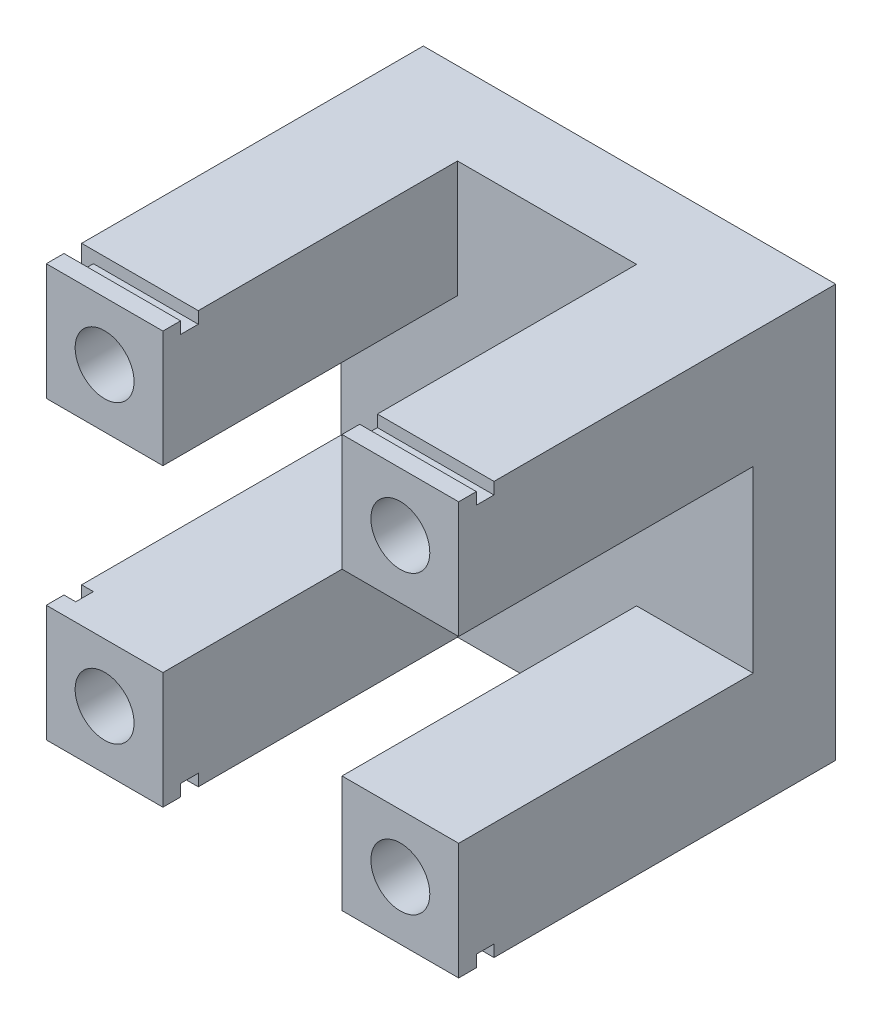
ISO-10303-21;
HEADER;
FILE_DESCRIPTION(('STEP AP214'),'2;1');
FILE_NAME('part.step','',(''),(''),'','','');
FILE_SCHEMA(('AUTOMOTIVE_DESIGN { 1 0 10303 214 1 1 1 1 }'));
ENDSEC;
DATA;
#1=APPLICATION_CONTEXT('core data for automotive mechanical design processes');
#2=APPLICATION_PROTOCOL_DEFINITION('international standard','automotive_design',2000,#1);
#3=PRODUCT_CONTEXT('',#1,'mechanical');
#4=PRODUCT('Part','Part','',(#3));
#5=PRODUCT_RELATED_PRODUCT_CATEGORY('part','',(#4));
#6=PRODUCT_DEFINITION_FORMATION('','',#4);
#7=PRODUCT_DEFINITION_CONTEXT('part definition',#1,'design');
#8=PRODUCT_DEFINITION('design','',#6,#7);
#9=PRODUCT_DEFINITION_SHAPE('','',#8);
#10=(LENGTH_UNIT() NAMED_UNIT(*) SI_UNIT(.MILLI.,.METRE.));
#11=(NAMED_UNIT(*) PLANE_ANGLE_UNIT() SI_UNIT($,.RADIAN.));
#12=(NAMED_UNIT(*) SI_UNIT($,.STERADIAN.) SOLID_ANGLE_UNIT());
#13=UNCERTAINTY_MEASURE_WITH_UNIT(LENGTH_MEASURE(1.E-05),#10,'distance_accuracy_value','');
#14=(GEOMETRIC_REPRESENTATION_CONTEXT(3) GLOBAL_UNCERTAINTY_ASSIGNED_CONTEXT((#13)) GLOBAL_UNIT_ASSIGNED_CONTEXT((#10,
#11,#12)) REPRESENTATION_CONTEXT('',''));
#15=CARTESIAN_POINT('',(0.,0.,0.));
#16=DIRECTION('',(0.,0.,1.));
#17=DIRECTION('',(1.,0.,0.));
#18=AXIS2_PLACEMENT_3D('',#15,#16,#17);
#19=CARTESIAN_POINT('',(-70.,0.,64.));
#20=DIRECTION('',(1.,0.,0.));
#21=DIRECTION('',(0.,0.,-1.));
#22=AXIS2_PLACEMENT_3D('',#19,#20,#21);
#23=PLANE('',#22);
#24=DIRECTION('',(0.,-1.,0.));
#25=VECTOR('',#24,1.);
#26=CARTESIAN_POINT('',(-70.,0.,58.));
#27=LINE('',#26,#25);
#28=CARTESIAN_POINT('',(-70.,19.8,58.));
#29=VERTEX_POINT('',#28);
#30=CARTESIAN_POINT('',(-70.,0.,58.));
#31=VERTEX_POINT('',#30);
#32=EDGE_CURVE('E303',#29,#31,#27,.T.);
#33=ORIENTED_EDGE('',*,*,#32,.F.);
#34=DIRECTION('',(0.,0.,1.));
#35=VECTOR('',#34,1.);
#36=CARTESIAN_POINT('',(-70.,19.8,14.));
#37=LINE('',#36,#35);
#38=CARTESIAN_POINT('',(-70.,19.8,14.));
#39=VERTEX_POINT('',#38);
#40=EDGE_CURVE('E454',#39,#29,#37,.T.);
#41=ORIENTED_EDGE('',*,*,#40,.F.);
#42=DIRECTION('',(0.,-1.,0.));
#43=VECTOR('',#42,1.);
#44=CARTESIAN_POINT('',(-70.,0.,14.));
#45=LINE('',#44,#43);
#46=CARTESIAN_POINT('',(-70.,50.2,14.));
#47=VERTEX_POINT('',#46);
#48=EDGE_CURVE('E376',#47,#39,#45,.T.);
#49=ORIENTED_EDGE('',*,*,#48,.F.);
#50=DIRECTION('',(0.,0.,1.));
#51=VECTOR('',#50,1.);
#52=CARTESIAN_POINT('',(-70.,50.2,14.));
#53=LINE('',#52,#51);
#54=CARTESIAN_POINT('',(-70.,50.2,58.));
#55=VERTEX_POINT('',#54);
#56=EDGE_CURVE('E457',#47,#55,#53,.T.);
#57=ORIENTED_EDGE('',*,*,#56,.T.);
#58=DIRECTION('',(0.,-1.,0.));
#59=VECTOR('',#58,1.);
#60=CARTESIAN_POINT('',(-70.,70.,58.));
#61=LINE('',#60,#59);
#62=CARTESIAN_POINT('',(-70.,70.,58.));
#63=VERTEX_POINT('',#62);
#64=EDGE_CURVE('E339',#63,#55,#61,.T.);
#65=ORIENTED_EDGE('',*,*,#64,.F.);
#66=DIRECTION('',(0.,0.,-1.));
#67=VECTOR('',#66,1.);
#68=CARTESIAN_POINT('',(-70.,70.,64.));
#69=LINE('',#68,#67);
#70=CARTESIAN_POINT('',(-70.,70.,0.));
#71=VERTEX_POINT('',#70);
#72=EDGE_CURVE('E498',#63,#71,#69,.T.);
#73=ORIENTED_EDGE('',*,*,#72,.T.);
#74=DIRECTION('',(0.,-1.,0.));
#75=VECTOR('',#74,1.);
#76=CARTESIAN_POINT('',(-70.,0.,0.));
#77=LINE('',#76,#75);
#78=CARTESIAN_POINT('',(-70.,0.,0.));
#79=VERTEX_POINT('',#78);
#80=EDGE_CURVE('E485',#71,#79,#77,.T.);
#81=ORIENTED_EDGE('',*,*,#80,.T.);
#82=DIRECTION('',(0.,0.,-1.));
#83=VECTOR('',#82,1.);
#84=CARTESIAN_POINT('',(-70.,0.,64.));
#85=LINE('',#84,#83);
#86=EDGE_CURVE('E494',#31,#79,#85,.T.);
#87=ORIENTED_EDGE('',*,*,#86,.F.);
#88=EDGE_LOOP('',(#33,#41,#49,#57,#65,#73,#81,#87));
#89=FACE_BOUND('',#88,.T.);
#90=ADVANCED_FACE('F33',(#89),#23,.F.);
#91=DIRECTION('',(0.,1.,0.));
#92=VECTOR('',#91,1.);
#93=CARTESIAN_POINT('',(-70.,70.,61.));
#94=LINE('',#93,#92);
#95=CARTESIAN_POINT('',(-70.,50.2,61.));
#96=VERTEX_POINT('',#95);
#97=CARTESIAN_POINT('',(-70.,70.,61.));
#98=VERTEX_POINT('',#97);
#99=EDGE_CURVE('E334',#96,#98,#94,.T.);
#100=ORIENTED_EDGE('',*,*,#99,.F.);
#101=CARTESIAN_POINT('',(-70.,50.2,64.));
#102=VERTEX_POINT('',#101);
#103=EDGE_CURVE('E460',#96,#102,#53,.T.);
#104=ORIENTED_EDGE('',*,*,#103,.T.);
#105=DIRECTION('',(0.,-1.,0.));
#106=VECTOR('',#105,1.);
#107=CARTESIAN_POINT('',(-70.,0.,64.));
#108=LINE('',#107,#106);
#109=CARTESIAN_POINT('',(-70.,70.,64.));
#110=VERTEX_POINT('',#109);
#111=EDGE_CURVE('E472',#110,#102,#108,.T.);
#112=ORIENTED_EDGE('',*,*,#111,.F.);
#113=EDGE_CURVE('E499',#110,#98,#69,.T.);
#114=ORIENTED_EDGE('',*,*,#113,.T.);
#115=EDGE_LOOP('',(#100,#104,#112,#114));
#116=FACE_BOUND('',#115,.T.);
#117=ADVANCED_FACE('F672',(#116),#23,.F.);
#118=CARTESIAN_POINT('',(0.,0.,64.));
#119=DIRECTION('',(0.,1.,0.));
#120=DIRECTION('',(-1.,0.,0.));
#121=AXIS2_PLACEMENT_3D('',#118,#119,#120);
#122=PLANE('',#121);
#123=DIRECTION('',(0.,0.,1.));
#124=VECTOR('',#123,1.);
#125=CARTESIAN_POINT('',(-19.8,0.,14.));
#126=LINE('',#125,#124);
#127=CARTESIAN_POINT('',(-19.8,0.,61.));
#128=VERTEX_POINT('',#127);
#129=CARTESIAN_POINT('',(-19.8,0.,64.));
#130=VERTEX_POINT('',#129);
#131=EDGE_CURVE('E447',#128,#130,#126,.T.);
#132=ORIENTED_EDGE('',*,*,#131,.F.);
#133=DIRECTION('',(-1.,0.,0.));
#134=VECTOR('',#133,1.);
#135=CARTESIAN_POINT('',(0.,0.,61.));
#136=LINE('',#135,#134);
#137=CARTESIAN_POINT('',(0.,0.,61.));
#138=VERTEX_POINT('',#137);
#139=EDGE_CURVE('E313',#138,#128,#136,.T.);
#140=ORIENTED_EDGE('',*,*,#139,.F.);
#141=DIRECTION('',(0.,0.,-1.));
#142=VECTOR('',#141,1.);
#143=CARTESIAN_POINT('',(0.,0.,64.));
#144=LINE('',#143,#142);
#145=CARTESIAN_POINT('',(0.,0.,64.));
#146=VERTEX_POINT('',#145);
#147=EDGE_CURVE('E491',#146,#138,#144,.T.);
#148=ORIENTED_EDGE('',*,*,#147,.F.);
#149=DIRECTION('',(1.,0.,0.));
#150=VECTOR('',#149,1.);
#151=CARTESIAN_POINT('',(0.,0.,64.));
#152=LINE('',#151,#150);
#153=EDGE_CURVE('E475',#130,#146,#152,.T.);
#154=ORIENTED_EDGE('',*,*,#153,.F.);
#155=EDGE_LOOP('',(#132,#140,#148,#154));
#156=FACE_BOUND('',#155,.T.);
#157=ADVANCED_FACE('F628',(#156),#122,.F.);
#158=CARTESIAN_POINT('',(-70.,0.,64.));
#159=VERTEX_POINT('',#158);
#160=CARTESIAN_POINT('',(-70.,0.,61.));
#161=VERTEX_POINT('',#160);
#162=EDGE_CURVE('E495',#159,#161,#85,.T.);
#163=ORIENTED_EDGE('',*,*,#162,.T.);
#164=CARTESIAN_POINT('',(-50.2,0.,61.));
#165=VERTEX_POINT('',#164);
#166=EDGE_CURVE('E316',#165,#161,#136,.T.);
#167=ORIENTED_EDGE('',*,*,#166,.F.);
#168=DIRECTION('',(0.,0.,1.));
#169=VECTOR('',#168,1.);
#170=CARTESIAN_POINT('',(-50.2,0.,14.));
#171=LINE('',#170,#169);
#172=CARTESIAN_POINT('',(-50.2,0.,64.));
#173=VERTEX_POINT('',#172);
#174=EDGE_CURVE('E451',#165,#173,#171,.T.);
#175=ORIENTED_EDGE('',*,*,#174,.T.);
#176=EDGE_CURVE('E476',#159,#173,#152,.T.);
#177=ORIENTED_EDGE('',*,*,#176,.F.);
#178=EDGE_LOOP('',(#163,#167,#175,#177));
#179=FACE_BOUND('',#178,.T.);
#180=ADVANCED_FACE('F530',(#179),#122,.F.);
#181=CARTESIAN_POINT('',(0.,70.,64.));
#182=DIRECTION('',(0.,-1.,0.));
#183=DIRECTION('',(0.,0.,-1.));
#184=AXIS2_PLACEMENT_3D('',#181,#182,#183);
#185=PLANE('',#184);
#186=DIRECTION('',(0.,0.,1.));
#187=VECTOR('',#186,1.);
#188=CARTESIAN_POINT('',(-50.2,70.,14.));
#189=LINE('',#188,#187);
#190=CARTESIAN_POINT('',(-50.2,70.,61.));
#191=VERTEX_POINT('',#190);
#192=CARTESIAN_POINT('',(-50.2,70.,64.));
#193=VERTEX_POINT('',#192);
#194=EDGE_CURVE('E430',#191,#193,#189,.T.);
#195=ORIENTED_EDGE('',*,*,#194,.F.);
#196=DIRECTION('',(-1.,0.,0.));
#197=VECTOR('',#196,1.);
#198=CARTESIAN_POINT('',(0.,70.,61.));
#199=LINE('',#198,#197);
#200=EDGE_CURVE('E345',#191,#98,#199,.T.);
#201=ORIENTED_EDGE('',*,*,#200,.T.);
#202=ORIENTED_EDGE('',*,*,#113,.F.);
#203=DIRECTION('',(-1.,0.,0.));
#204=VECTOR('',#203,1.);
#205=CARTESIAN_POINT('',(0.,70.,64.));
#206=LINE('',#205,#204);
#207=EDGE_CURVE('E466',#193,#110,#206,.T.);
#208=ORIENTED_EDGE('',*,*,#207,.F.);
#209=EDGE_LOOP('',(#195,#201,#202,#208));
#210=FACE_BOUND('',#209,.T.);
#211=ADVANCED_FACE('F579',(#210),#185,.F.);
#212=DIRECTION('',(0.,0.,-1.));
#213=VECTOR('',#212,1.);
#214=CARTESIAN_POINT('',(0.,70.,64.));
#215=LINE('',#214,#213);
#216=CARTESIAN_POINT('',(0.,70.,64.));
#217=VERTEX_POINT('',#216);
#218=CARTESIAN_POINT('',(0.,70.,61.));
#219=VERTEX_POINT('',#218);
#220=EDGE_CURVE('E503',#217,#219,#215,.T.);
#221=ORIENTED_EDGE('',*,*,#220,.T.);
#222=CARTESIAN_POINT('',(-19.8,70.,61.));
#223=VERTEX_POINT('',#222);
#224=EDGE_CURVE('E361',#219,#223,#199,.T.);
#225=ORIENTED_EDGE('',*,*,#224,.T.);
#226=DIRECTION('',(0.,0.,1.));
#227=VECTOR('',#226,1.);
#228=CARTESIAN_POINT('',(-19.8,70.,14.));
#229=LINE('',#228,#227);
#230=CARTESIAN_POINT('',(-19.8,70.,64.));
#231=VERTEX_POINT('',#230);
#232=EDGE_CURVE('E434',#223,#231,#229,.T.);
#233=ORIENTED_EDGE('',*,*,#232,.T.);
#234=EDGE_CURVE('E468',#217,#231,#206,.T.);
#235=ORIENTED_EDGE('',*,*,#234,.F.);
#236=EDGE_LOOP('',(#221,#225,#233,#235));
#237=FACE_BOUND('',#236,.T.);
#238=ADVANCED_FACE('F654',(#237),#185,.F.);
#239=CARTESIAN_POINT('',(0.,0.,64.));
#240=DIRECTION('',(-1.,0.,0.));
#241=DIRECTION('',(0.,0.,1.));
#242=AXIS2_PLACEMENT_3D('',#239,#240,#241);
#243=PLANE('',#242);
#244=ORIENTED_EDGE('',*,*,#147,.T.);
#245=DIRECTION('',(0.,1.,0.));
#246=VECTOR('',#245,1.);
#247=CARTESIAN_POINT('',(0.,0.,61.));
#248=LINE('',#247,#246);
#249=CARTESIAN_POINT('',(0.,1.99999999999999,61.));
#250=VERTEX_POINT('',#249);
#251=EDGE_CURVE('E299',#138,#250,#248,.T.);
#252=ORIENTED_EDGE('',*,*,#251,.T.);
#253=DIRECTION('',(0.,0.,-1.));
#254=VECTOR('',#253,1.);
#255=CARTESIAN_POINT('',(0.,1.99999999999999,61.));
#256=LINE('',#255,#254);
#257=CARTESIAN_POINT('',(0.,1.99999999999999,58.));
#258=VERTEX_POINT('',#257);
#259=EDGE_CURVE('E302',#250,#258,#256,.T.);
#260=ORIENTED_EDGE('',*,*,#259,.T.);
#261=DIRECTION('',(0.,-1.,0.));
#262=VECTOR('',#261,1.);
#263=CARTESIAN_POINT('',(0.,0.,58.));
#264=LINE('',#263,#262);
#265=CARTESIAN_POINT('',(0.,0.,58.));
#266=VERTEX_POINT('',#265);
#267=EDGE_CURVE('E306',#258,#266,#264,.T.);
#268=ORIENTED_EDGE('',*,*,#267,.T.);
#269=CARTESIAN_POINT('',(0.,0.,0.));
#270=VERTEX_POINT('',#269);
#271=EDGE_CURVE('E479',#266,#270,#144,.T.);
#272=ORIENTED_EDGE('',*,*,#271,.T.);
#273=DIRECTION('',(0.,1.,0.));
#274=VECTOR('',#273,1.);
#275=CARTESIAN_POINT('',(0.,0.,0.));
#276=LINE('',#275,#274);
#277=CARTESIAN_POINT('',(0.,70.,0.));
#278=VERTEX_POINT('',#277);
#279=EDGE_CURVE('E429',#270,#278,#276,.T.);
#280=ORIENTED_EDGE('',*,*,#279,.T.);
#281=CARTESIAN_POINT('',(0.,70.,58.));
#282=VERTEX_POINT('',#281);
#283=EDGE_CURVE('E502',#282,#278,#215,.T.);
#284=ORIENTED_EDGE('',*,*,#283,.F.);
#285=DIRECTION('',(0.,-1.,0.));
#286=VECTOR('',#285,1.);
#287=CARTESIAN_POINT('',(0.,70.,58.));
#288=LINE('',#287,#286);
#289=CARTESIAN_POINT('',(0.,68.,58.));
#290=VERTEX_POINT('',#289);
#291=EDGE_CURVE('E338',#282,#290,#288,.T.);
#292=ORIENTED_EDGE('',*,*,#291,.T.);
#293=DIRECTION('',(0.,0.,1.));
#294=VECTOR('',#293,1.);
#295=CARTESIAN_POINT('',(0.,68.,61.));
#296=LINE('',#295,#294);
#297=CARTESIAN_POINT('',(0.,68.,61.));
#298=VERTEX_POINT('',#297);
#299=EDGE_CURVE('E342',#290,#298,#296,.T.);
#300=ORIENTED_EDGE('',*,*,#299,.T.);
#301=DIRECTION('',(0.,1.,0.));
#302=VECTOR('',#301,1.);
#303=CARTESIAN_POINT('',(0.,70.,61.));
#304=LINE('',#303,#302);
#305=EDGE_CURVE('E335',#298,#219,#304,.T.);
#306=ORIENTED_EDGE('',*,*,#305,.T.);
#307=ORIENTED_EDGE('',*,*,#220,.F.);
#308=DIRECTION('',(0.,1.,0.));
#309=VECTOR('',#308,1.);
#310=CARTESIAN_POINT('',(0.,0.,64.));
#311=LINE('',#310,#309);
#312=CARTESIAN_POINT('',(0.,50.2,64.));
#313=VERTEX_POINT('',#312);
#314=EDGE_CURVE('E467',#313,#217,#311,.T.);
#315=ORIENTED_EDGE('',*,*,#314,.F.);
#316=DIRECTION('',(0.,0.,1.));
#317=VECTOR('',#316,1.);
#318=CARTESIAN_POINT('',(0.,50.2,14.));
#319=LINE('',#318,#317);
#320=CARTESIAN_POINT('',(0.,50.2,14.));
#321=VERTEX_POINT('',#320);
#322=EDGE_CURVE('E437',#321,#313,#319,.T.);
#323=ORIENTED_EDGE('',*,*,#322,.F.);
#324=DIRECTION('',(0.,1.,0.));
#325=VECTOR('',#324,1.);
#326=CARTESIAN_POINT('',(0.,0.,14.));
#327=LINE('',#326,#325);
#328=CARTESIAN_POINT('',(0.,19.8,14.));
#329=VERTEX_POINT('',#328);
#330=EDGE_CURVE('E393',#329,#321,#327,.T.);
#331=ORIENTED_EDGE('',*,*,#330,.F.);
#332=DIRECTION('',(0.,0.,1.));
#333=VECTOR('',#332,1.);
#334=CARTESIAN_POINT('',(0.,19.8,14.));
#335=LINE('',#334,#333);
#336=CARTESIAN_POINT('',(0.,19.8,64.));
#337=VERTEX_POINT('',#336);
#338=EDGE_CURVE('E439',#329,#337,#335,.T.);
#339=ORIENTED_EDGE('',*,*,#338,.T.);
#340=EDGE_CURVE('E463',#146,#337,#311,.T.);
#341=ORIENTED_EDGE('',*,*,#340,.F.);
#342=EDGE_LOOP('',(#244,#252,#260,#268,#272,#280,#284,#292,#300,#306,#307,#315,#323,#331,#339,#341));
#343=FACE_BOUND('',#342,.T.);
#344=ADVANCED_FACE('F35',(#343),#243,.F.);
#345=ORIENTED_EDGE('',*,*,#72,.F.);
#346=DIRECTION('',(-1.,0.,0.));
#347=VECTOR('',#346,1.);
#348=CARTESIAN_POINT('',(0.,70.,58.));
#349=LINE('',#348,#347);
#350=CARTESIAN_POINT('',(-50.2,70.,58.));
#351=VERTEX_POINT('',#350);
#352=EDGE_CURVE('E360',#351,#63,#349,.T.);
#353=ORIENTED_EDGE('',*,*,#352,.F.);
#354=CARTESIAN_POINT('',(-50.2,70.,14.));
#355=VERTEX_POINT('',#354);
#356=EDGE_CURVE('E426',#355,#351,#189,.T.);
#357=ORIENTED_EDGE('',*,*,#356,.F.);
#358=DIRECTION('',(-1.,0.,0.));
#359=VECTOR('',#358,1.);
#360=CARTESIAN_POINT('',(0.,70.,14.));
#361=LINE('',#360,#359);
#362=CARTESIAN_POINT('',(-19.8,70.,14.));
#363=VERTEX_POINT('',#362);
#364=EDGE_CURVE('E401',#363,#355,#361,.T.);
#365=ORIENTED_EDGE('',*,*,#364,.F.);
#366=CARTESIAN_POINT('',(-19.8,70.,58.));
#367=VERTEX_POINT('',#366);
#368=EDGE_CURVE('E431',#363,#367,#229,.T.);
#369=ORIENTED_EDGE('',*,*,#368,.T.);
#370=EDGE_CURVE('E358',#282,#367,#349,.T.);
#371=ORIENTED_EDGE('',*,*,#370,.F.);
#372=ORIENTED_EDGE('',*,*,#283,.T.);
#373=DIRECTION('',(-1.,0.,0.));
#374=VECTOR('',#373,1.);
#375=CARTESIAN_POINT('',(0.,70.,0.));
#376=LINE('',#375,#374);
#377=EDGE_CURVE('E482',#278,#71,#376,.T.);
#378=ORIENTED_EDGE('',*,*,#377,.T.);
#379=EDGE_LOOP('',(#345,#353,#357,#365,#369,#371,#372,#378));
#380=FACE_BOUND('',#379,.T.);
#381=ADVANCED_FACE('F596',(#380),#185,.F.);
#382=CARTESIAN_POINT('',(0.,0.,64.));
#383=DIRECTION('',(0.,0.,1.));
#384=DIRECTION('',(1.,0.,0.));
#385=AXIS2_PLACEMENT_3D('',#382,#383,#384);
#386=PLANE('',#385);
#387=CARTESIAN_POINT('',(-9.90000000000009,60.1000000000001,64.));
#388=DIRECTION('',(0.,0.,1.));
#389=DIRECTION('',(0.,1.,0.));
#390=AXIS2_PLACEMENT_3D('',#387,#388,#389);
#391=CIRCLE('',#390,5.);
#392=CARTESIAN_POINT('',(-9.90000000000011,65.1000000000001,64.));
#393=VERTEX_POINT('',#392);
#394=EDGE_CURVE('E707',#393,#393,#391,.T.);
#395=ORIENTED_EDGE('',*,*,#394,.F.);
#396=EDGE_LOOP('',(#395));
#397=FACE_BOUND('',#396,.T.);
#398=DIRECTION('',(0.,1.,0.));
#399=VECTOR('',#398,1.);
#400=CARTESIAN_POINT('',(-19.8,0.,64.));
#401=LINE('',#400,#399);
#402=CARTESIAN_POINT('',(-19.8,50.2,64.));
#403=VERTEX_POINT('',#402);
#404=EDGE_CURVE('E374',#403,#231,#401,.T.);
#405=ORIENTED_EDGE('',*,*,#404,.F.);
#406=DIRECTION('',(1.,0.,0.));
#407=VECTOR('',#406,1.);
#408=CARTESIAN_POINT('',(0.,50.2,64.));
#409=LINE('',#408,#407);
#410=EDGE_CURVE('E421',#403,#313,#409,.T.);
#411=ORIENTED_EDGE('',*,*,#410,.T.);
#412=ORIENTED_EDGE('',*,*,#314,.T.);
#413=ORIENTED_EDGE('',*,*,#234,.T.);
#414=EDGE_LOOP('',(#405,#411,#412,#413));
#415=FACE_BOUND('',#414,.T.);
#416=ADVANCED_FACE('F650',(#397,#415),#386,.T.);
#417=CARTESIAN_POINT('',(-60.0999999999998,9.89999999999975,64.));
#418=DIRECTION('',(0.,0.,1.));
#419=DIRECTION('',(0.,-1.,0.));
#420=AXIS2_PLACEMENT_3D('',#417,#418,#419);
#421=CIRCLE('',#420,5.);
#422=CARTESIAN_POINT('',(-60.0999999999997,4.89999999999974,64.));
#423=VERTEX_POINT('',#422);
#424=EDGE_CURVE('E828',#423,#423,#421,.T.);
#425=ORIENTED_EDGE('',*,*,#424,.F.);
#426=EDGE_LOOP('',(#425));
#427=FACE_BOUND('',#426,.T.);
#428=ORIENTED_EDGE('',*,*,#176,.T.);
#429=DIRECTION('',(0.,1.,0.));
#430=VECTOR('',#429,1.);
#431=CARTESIAN_POINT('',(-50.2,0.,64.));
#432=LINE('',#431,#430);
#433=CARTESIAN_POINT('',(-50.2,19.8,64.));
#434=VERTEX_POINT('',#433);
#435=EDGE_CURVE('E413',#173,#434,#432,.T.);
#436=ORIENTED_EDGE('',*,*,#435,.T.);
#437=DIRECTION('',(1.,0.,0.));
#438=VECTOR('',#437,1.);
#439=CARTESIAN_POINT('',(0.,19.8,64.));
#440=LINE('',#439,#438);
#441=CARTESIAN_POINT('',(-70.,19.8,64.));
#442=VERTEX_POINT('',#441);
#443=EDGE_CURVE('E410',#442,#434,#440,.T.);
#444=ORIENTED_EDGE('',*,*,#443,.F.);
#445=EDGE_CURVE('E471',#442,#159,#108,.T.);
#446=ORIENTED_EDGE('',*,*,#445,.T.);
#447=EDGE_LOOP('',(#428,#436,#444,#446));
#448=FACE_BOUND('',#447,.T.);
#449=ADVANCED_FACE('F537',(#427,#448),#386,.T.);
#450=CARTESIAN_POINT('',(-60.1,60.1,64.));
#451=DIRECTION('',(0.,0.,1.));
#452=DIRECTION('',(-1.,0.,0.));
#453=AXIS2_PLACEMENT_3D('',#450,#451,#452);
#454=CIRCLE('',#453,5.);
#455=CARTESIAN_POINT('',(-65.1,60.1,64.));
#456=VERTEX_POINT('',#455);
#457=EDGE_CURVE('E715',#456,#456,#454,.T.);
#458=ORIENTED_EDGE('',*,*,#457,.F.);
#459=EDGE_LOOP('',(#458));
#460=FACE_BOUND('',#459,.T.);
#461=DIRECTION('',(1.,0.,0.));
#462=VECTOR('',#461,1.);
#463=CARTESIAN_POINT('',(0.,50.2,64.));
#464=LINE('',#463,#462);
#465=CARTESIAN_POINT('',(-50.2,50.2,64.));
#466=VERTEX_POINT('',#465);
#467=EDGE_CURVE('E407',#102,#466,#464,.T.);
#468=ORIENTED_EDGE('',*,*,#467,.T.);
#469=DIRECTION('',(0.,1.,0.));
#470=VECTOR('',#469,1.);
#471=CARTESIAN_POINT('',(-50.2,0.,64.));
#472=LINE('',#471,#470);
#473=EDGE_CURVE('E370',#466,#193,#472,.T.);
#474=ORIENTED_EDGE('',*,*,#473,.T.);
#475=ORIENTED_EDGE('',*,*,#207,.T.);
#476=ORIENTED_EDGE('',*,*,#111,.T.);
#477=EDGE_LOOP('',(#468,#474,#475,#476));
#478=FACE_BOUND('',#477,.T.);
#479=ADVANCED_FACE('F583',(#460,#478),#386,.T.);
#480=CARTESIAN_POINT('',(-70.,19.8,61.));
#481=VERTEX_POINT('',#480);
#482=EDGE_CURVE('E456',#481,#442,#37,.T.);
#483=ORIENTED_EDGE('',*,*,#482,.F.);
#484=DIRECTION('',(0.,1.,0.));
#485=VECTOR('',#484,1.);
#486=CARTESIAN_POINT('',(-70.,0.,61.));
#487=LINE('',#486,#485);
#488=EDGE_CURVE('E267',#161,#481,#487,.T.);
#489=ORIENTED_EDGE('',*,*,#488,.F.);
#490=ORIENTED_EDGE('',*,*,#162,.F.);
#491=ORIENTED_EDGE('',*,*,#445,.F.);
#492=EDGE_LOOP('',(#483,#489,#490,#491));
#493=FACE_BOUND('',#492,.T.);
#494=ADVANCED_FACE('F540',(#493),#23,.F.);
#495=ORIENTED_EDGE('',*,*,#271,.F.);
#496=DIRECTION('',(-1.,0.,0.));
#497=VECTOR('',#496,1.);
#498=CARTESIAN_POINT('',(0.,0.,58.));
#499=LINE('',#498,#497);
#500=CARTESIAN_POINT('',(-19.8,0.,58.));
#501=VERTEX_POINT('',#500);
#502=EDGE_CURVE('E317',#266,#501,#499,.T.);
#503=ORIENTED_EDGE('',*,*,#502,.T.);
#504=CARTESIAN_POINT('',(-19.8,0.,14.));
#505=VERTEX_POINT('',#504);
#506=EDGE_CURVE('E444',#505,#501,#126,.T.);
#507=ORIENTED_EDGE('',*,*,#506,.F.);
#508=DIRECTION('',(1.,0.,0.));
#509=VECTOR('',#508,1.);
#510=CARTESIAN_POINT('',(0.,0.,14.));
#511=LINE('',#510,#509);
#512=CARTESIAN_POINT('',(-50.2,0.,14.));
#513=VERTEX_POINT('',#512);
#514=EDGE_CURVE('E384',#513,#505,#511,.T.);
#515=ORIENTED_EDGE('',*,*,#514,.F.);
#516=CARTESIAN_POINT('',(-50.2,0.,58.));
#517=VERTEX_POINT('',#516);
#518=EDGE_CURVE('E448',#513,#517,#171,.T.);
#519=ORIENTED_EDGE('',*,*,#518,.T.);
#520=EDGE_CURVE('E320',#517,#31,#499,.T.);
#521=ORIENTED_EDGE('',*,*,#520,.T.);
#522=ORIENTED_EDGE('',*,*,#86,.T.);
#523=DIRECTION('',(1.,0.,0.));
#524=VECTOR('',#523,1.);
#525=CARTESIAN_POINT('',(0.,0.,0.));
#526=LINE('',#525,#524);
#527=EDGE_CURVE('E488',#79,#270,#526,.T.);
#528=ORIENTED_EDGE('',*,*,#527,.T.);
#529=EDGE_LOOP('',(#495,#503,#507,#515,#519,#521,#522,#528));
#530=FACE_BOUND('',#529,.T.);
#531=ADVANCED_FACE('F608',(#530),#122,.F.);
#532=CARTESIAN_POINT('',(-9.90000000000001,9.9,64.));
#533=DIRECTION('',(0.,0.,1.));
#534=DIRECTION('',(1.,0.,0.));
#535=AXIS2_PLACEMENT_3D('',#532,#533,#534);
#536=CIRCLE('',#535,5.);
#537=CARTESIAN_POINT('',(-4.90000000000001,9.9,64.));
#538=VERTEX_POINT('',#537);
#539=EDGE_CURVE('E556',#538,#538,#536,.T.);
#540=ORIENTED_EDGE('',*,*,#539,.F.);
#541=EDGE_LOOP('',(#540));
#542=FACE_BOUND('',#541,.T.);
#543=DIRECTION('',(1.,0.,0.));
#544=VECTOR('',#543,1.);
#545=CARTESIAN_POINT('',(0.,19.8,64.));
#546=LINE('',#545,#544);
#547=CARTESIAN_POINT('',(-19.8,19.8,64.));
#548=VERTEX_POINT('',#547);
#549=EDGE_CURVE('E419',#548,#337,#546,.T.);
#550=ORIENTED_EDGE('',*,*,#549,.F.);
#551=DIRECTION('',(0.,1.,0.));
#552=VECTOR('',#551,1.);
#553=CARTESIAN_POINT('',(-19.8,0.,64.));
#554=LINE('',#553,#552);
#555=EDGE_CURVE('E416',#130,#548,#554,.T.);
#556=ORIENTED_EDGE('',*,*,#555,.F.);
#557=ORIENTED_EDGE('',*,*,#153,.T.);
#558=ORIENTED_EDGE('',*,*,#340,.T.);
#559=EDGE_LOOP('',(#550,#556,#557,#558));
#560=FACE_BOUND('',#559,.T.);
#561=ADVANCED_FACE('F622',(#542,#560),#386,.T.);
#562=CARTESIAN_POINT('',(0.,0.,0.));
#563=DIRECTION('',(0.,0.,1.));
#564=DIRECTION('',(1.,0.,0.));
#565=AXIS2_PLACEMENT_3D('',#562,#563,#564);
#566=PLANE('',#565);
#567=CARTESIAN_POINT('',(-60.0999999999998,9.89999999999975,0.));
#568=DIRECTION('',(0.,0.,1.));
#569=DIRECTION('',(0.,-1.,0.));
#570=AXIS2_PLACEMENT_3D('',#567,#568,#569);
#571=CIRCLE('',#570,5.);
#572=CARTESIAN_POINT('',(-60.0999999999997,4.89999999999974,0.));
#573=VERTEX_POINT('',#572);
#574=EDGE_CURVE('E825',#573,#573,#571,.T.);
#575=ORIENTED_EDGE('',*,*,#574,.T.);
#576=EDGE_LOOP('',(#575));
#577=FACE_BOUND('',#576,.T.);
#578=CARTESIAN_POINT('',(-60.1,60.1,0.));
#579=DIRECTION('',(0.,0.,1.));
#580=DIRECTION('',(-1.,0.,0.));
#581=AXIS2_PLACEMENT_3D('',#578,#579,#580);
#582=CIRCLE('',#581,5.);
#583=CARTESIAN_POINT('',(-65.1,60.1,0.));
#584=VERTEX_POINT('',#583);
#585=EDGE_CURVE('E710',#584,#584,#582,.T.);
#586=ORIENTED_EDGE('',*,*,#585,.T.);
#587=EDGE_LOOP('',(#586));
#588=FACE_BOUND('',#587,.T.);
#589=CARTESIAN_POINT('',(-9.90000000000009,60.1000000000001,0.));
#590=DIRECTION('',(0.,0.,1.));
#591=DIRECTION('',(0.,1.,0.));
#592=AXIS2_PLACEMENT_3D('',#589,#590,#591);
#593=CIRCLE('',#592,5.);
#594=CARTESIAN_POINT('',(-9.90000000000011,65.1000000000001,0.));
#595=VERTEX_POINT('',#594);
#596=EDGE_CURVE('E709',#595,#595,#593,.T.);
#597=ORIENTED_EDGE('',*,*,#596,.T.);
#598=EDGE_LOOP('',(#597));
#599=FACE_BOUND('',#598,.T.);
#600=CARTESIAN_POINT('',(-9.90000000000001,9.9,0.));
#601=DIRECTION('',(0.,0.,1.));
#602=DIRECTION('',(1.,0.,0.));
#603=AXIS2_PLACEMENT_3D('',#600,#601,#602);
#604=CIRCLE('',#603,5.);
#605=CARTESIAN_POINT('',(-4.90000000000001,9.9,0.));
#606=VERTEX_POINT('',#605);
#607=EDGE_CURVE('E558',#606,#606,#604,.T.);
#608=ORIENTED_EDGE('',*,*,#607,.T.);
#609=EDGE_LOOP('',(#608));
#610=FACE_BOUND('',#609,.T.);
#611=ORIENTED_EDGE('',*,*,#279,.F.);
#612=ORIENTED_EDGE('',*,*,#527,.F.);
#613=ORIENTED_EDGE('',*,*,#80,.F.);
#614=ORIENTED_EDGE('',*,*,#377,.F.);
#615=EDGE_LOOP('',(#611,#612,#613,#614));
#616=FACE_BOUND('',#615,.T.);
#617=ADVANCED_FACE('F605',(#577,#588,#599,#610,#616),#566,.F.);
#618=CARTESIAN_POINT('',(-50.2,0.,14.));
#619=DIRECTION('',(1.,0.,0.));
#620=DIRECTION('',(0.,0.,-1.));
#621=AXIS2_PLACEMENT_3D('',#618,#619,#620);
#622=PLANE('',#621);
#623=DIRECTION('',(0.,-1.,0.));
#624=VECTOR('',#623,1.);
#625=CARTESIAN_POINT('',(-50.2,1.63064006741821E-13,61.0000000000002));
#626=LINE('',#625,#624);
#627=CARTESIAN_POINT('',(-50.2,68.,61.));
#628=VERTEX_POINT('',#627);
#629=EDGE_CURVE('E368',#191,#628,#626,.T.);
#630=ORIENTED_EDGE('',*,*,#629,.F.);
#631=ORIENTED_EDGE('',*,*,#194,.T.);
#632=ORIENTED_EDGE('',*,*,#473,.F.);
#633=DIRECTION('',(0.,0.,1.));
#634=VECTOR('',#633,1.);
#635=CARTESIAN_POINT('',(-50.2,50.2,14.));
#636=LINE('',#635,#634);
#637=CARTESIAN_POINT('',(-50.2,50.2,14.));
#638=VERTEX_POINT('',#637);
#639=EDGE_CURVE('E404',#638,#466,#636,.T.);
#640=ORIENTED_EDGE('',*,*,#639,.F.);
#641=DIRECTION('',(0.,1.,0.));
#642=VECTOR('',#641,1.);
#643=CARTESIAN_POINT('',(-50.2,0.,14.));
#644=LINE('',#643,#642);
#645=EDGE_CURVE('E371',#638,#355,#644,.T.);
#646=ORIENTED_EDGE('',*,*,#645,.T.);
#647=ORIENTED_EDGE('',*,*,#356,.T.);
#648=DIRECTION('',(0.,1.,0.));
#649=VECTOR('',#648,1.);
#650=CARTESIAN_POINT('',(-50.2,0.,58.));
#651=LINE('',#650,#649);
#652=CARTESIAN_POINT('',(-50.2,68.,58.));
#653=VERTEX_POINT('',#652);
#654=EDGE_CURVE('E352',#653,#351,#651,.T.);
#655=ORIENTED_EDGE('',*,*,#654,.F.);
#656=DIRECTION('',(0.,0.,-1.));
#657=VECTOR('',#656,1.);
#658=CARTESIAN_POINT('',(-50.2,67.9999999999998,13.9999999999997));
#659=LINE('',#658,#657);
#660=EDGE_CURVE('E365',#628,#653,#659,.T.);
#661=ORIENTED_EDGE('',*,*,#660,.F.);
#662=EDGE_LOOP('',(#630,#631,#632,#640,#646,#647,#655,#661));
#663=FACE_BOUND('',#662,.T.);
#664=ADVANCED_FACE('F575',(#663),#622,.T.);
#665=CARTESIAN_POINT('',(-19.8,0.,14.));
#666=DIRECTION('',(1.,0.,0.));
#667=DIRECTION('',(0.,1.,0.));
#668=AXIS2_PLACEMENT_3D('',#665,#666,#667);
#669=PLANE('',#668);
#670=ORIENTED_EDGE('',*,*,#232,.F.);
#671=DIRECTION('',(0.,-1.,0.));
#672=VECTOR('',#671,1.);
#673=CARTESIAN_POINT('',(-19.8,1.64045364593945E-13,61.0000000000002));
#674=LINE('',#673,#672);
#675=CARTESIAN_POINT('',(-19.8,68.,61.));
#676=VERTEX_POINT('',#675);
#677=EDGE_CURVE('E512',#223,#676,#674,.T.);
#678=ORIENTED_EDGE('',*,*,#677,.T.);
#679=DIRECTION('',(0.,0.,-1.));
#680=VECTOR('',#679,1.);
#681=CARTESIAN_POINT('',(-19.8,67.9999999999998,13.9999999999997));
#682=LINE('',#681,#680);
#683=CARTESIAN_POINT('',(-19.8,68.,58.));
#684=VERTEX_POINT('',#683);
#685=EDGE_CURVE('E509',#676,#684,#682,.T.);
#686=ORIENTED_EDGE('',*,*,#685,.T.);
#687=DIRECTION('',(0.,1.,0.));
#688=VECTOR('',#687,1.);
#689=CARTESIAN_POINT('',(-19.8,0.,58.));
#690=LINE('',#689,#688);
#691=EDGE_CURVE('E506',#684,#367,#690,.T.);
#692=ORIENTED_EDGE('',*,*,#691,.T.);
#693=ORIENTED_EDGE('',*,*,#368,.F.);
#694=DIRECTION('',(0.,1.,0.));
#695=VECTOR('',#694,1.);
#696=CARTESIAN_POINT('',(-19.8,0.,14.));
#697=LINE('',#696,#695);
#698=CARTESIAN_POINT('',(-19.8,50.2,14.));
#699=VERTEX_POINT('',#698);
#700=EDGE_CURVE('E398',#699,#363,#697,.T.);
#701=ORIENTED_EDGE('',*,*,#700,.F.);
#702=DIRECTION('',(0.,0.,1.));
#703=VECTOR('',#702,1.);
#704=CARTESIAN_POINT('',(-19.8,50.2,14.));
#705=LINE('',#704,#703);
#706=EDGE_CURVE('E435',#699,#403,#705,.T.);
#707=ORIENTED_EDGE('',*,*,#706,.T.);
#708=ORIENTED_EDGE('',*,*,#404,.T.);
#709=EDGE_LOOP('',(#670,#678,#686,#692,#693,#701,#707,#708));
#710=FACE_BOUND('',#709,.T.);
#711=ADVANCED_FACE('F642',(#710),#669,.F.);
#712=CARTESIAN_POINT('',(0.,50.2,14.));
#713=DIRECTION('',(0.,-1.,0.));
#714=DIRECTION('',(0.,0.,-1.));
#715=AXIS2_PLACEMENT_3D('',#712,#713,#714);
#716=PLANE('',#715);
#717=ORIENTED_EDGE('',*,*,#410,.F.);
#718=ORIENTED_EDGE('',*,*,#706,.F.);
#719=DIRECTION('',(1.,0.,0.));
#720=VECTOR('',#719,1.);
#721=CARTESIAN_POINT('',(0.,50.2,14.));
#722=LINE('',#721,#720);
#723=EDGE_CURVE('E396',#699,#321,#722,.T.);
#724=ORIENTED_EDGE('',*,*,#723,.T.);
#725=ORIENTED_EDGE('',*,*,#322,.T.);
#726=EDGE_LOOP('',(#717,#718,#724,#725));
#727=FACE_BOUND('',#726,.T.);
#728=ADVANCED_FACE('F646',(#727),#716,.T.);
#729=CARTESIAN_POINT('',(0.,19.8,14.));
#730=DIRECTION('',(0.,-1.,0.));
#731=DIRECTION('',(0.,0.,-1.));
#732=AXIS2_PLACEMENT_3D('',#729,#730,#731);
#733=PLANE('',#732);
#734=ORIENTED_EDGE('',*,*,#549,.T.);
#735=ORIENTED_EDGE('',*,*,#338,.F.);
#736=DIRECTION('',(1.,0.,0.));
#737=VECTOR('',#736,1.);
#738=CARTESIAN_POINT('',(0.,19.8,14.));
#739=LINE('',#738,#737);
#740=CARTESIAN_POINT('',(-19.8,19.8,14.));
#741=VERTEX_POINT('',#740);
#742=EDGE_CURVE('E390',#741,#329,#739,.T.);
#743=ORIENTED_EDGE('',*,*,#742,.F.);
#744=DIRECTION('',(0.,0.,1.));
#745=VECTOR('',#744,1.);
#746=CARTESIAN_POINT('',(-19.8,19.8,14.));
#747=LINE('',#746,#745);
#748=EDGE_CURVE('E442',#741,#548,#747,.T.);
#749=ORIENTED_EDGE('',*,*,#748,.T.);
#750=EDGE_LOOP('',(#734,#735,#743,#749));
#751=FACE_BOUND('',#750,.T.);
#752=ADVANCED_FACE('F617',(#751),#733,.F.);
#753=CARTESIAN_POINT('',(-19.8,0.,14.));
#754=DIRECTION('',(1.,0.,0.));
#755=DIRECTION('',(0.,1.,0.));
#756=AXIS2_PLACEMENT_3D('',#753,#754,#755);
#757=PLANE('',#756);
#758=DIRECTION('',(0.,0.,1.));
#759=VECTOR('',#758,1.);
#760=CARTESIAN_POINT('',(-19.8,1.99999999999998,14.));
#761=LINE('',#760,#759);
#762=CARTESIAN_POINT('',(-19.8,1.99999999999999,58.));
#763=VERTEX_POINT('',#762);
#764=CARTESIAN_POINT('',(-19.8,1.99999999999999,61.));
#765=VERTEX_POINT('',#764);
#766=EDGE_CURVE('E315',#763,#765,#761,.T.);
#767=ORIENTED_EDGE('',*,*,#766,.T.);
#768=DIRECTION('',(0.,-1.,0.));
#769=VECTOR('',#768,1.);
#770=CARTESIAN_POINT('',(-19.8,0.,61.));
#771=LINE('',#770,#769);
#772=EDGE_CURVE('E331',#765,#128,#771,.T.);
#773=ORIENTED_EDGE('',*,*,#772,.T.);
#774=ORIENTED_EDGE('',*,*,#131,.T.);
#775=ORIENTED_EDGE('',*,*,#555,.T.);
#776=ORIENTED_EDGE('',*,*,#748,.F.);
#777=DIRECTION('',(0.,1.,0.));
#778=VECTOR('',#777,1.);
#779=CARTESIAN_POINT('',(-19.8,0.,14.));
#780=LINE('',#779,#778);
#781=EDGE_CURVE('E387',#505,#741,#780,.T.);
#782=ORIENTED_EDGE('',*,*,#781,.F.);
#783=ORIENTED_EDGE('',*,*,#506,.T.);
#784=DIRECTION('',(0.,1.,0.));
#785=VECTOR('',#784,1.);
#786=CARTESIAN_POINT('',(-19.8,0.,58.));
#787=LINE('',#786,#785);
#788=EDGE_CURVE('E328',#501,#763,#787,.T.);
#789=ORIENTED_EDGE('',*,*,#788,.T.);
#790=EDGE_LOOP('',(#767,#773,#774,#775,#776,#782,#783,#789));
#791=FACE_BOUND('',#790,.T.);
#792=ADVANCED_FACE('F613',(#791),#757,.F.);
#793=CARTESIAN_POINT('',(-50.2,0.,14.));
#794=DIRECTION('',(1.,0.,0.));
#795=DIRECTION('',(0.,0.,-1.));
#796=AXIS2_PLACEMENT_3D('',#793,#794,#795);
#797=PLANE('',#796);
#798=DIRECTION('',(0.,-1.,0.));
#799=VECTOR('',#798,1.);
#800=CARTESIAN_POINT('',(-50.2,0.,61.));
#801=LINE('',#800,#799);
#802=CARTESIAN_POINT('',(-50.2,1.99999999999999,61.));
#803=VERTEX_POINT('',#802);
#804=EDGE_CURVE('E11',#803,#165,#801,.T.);
#805=ORIENTED_EDGE('',*,*,#804,.F.);
#806=DIRECTION('',(0.,0.,1.));
#807=VECTOR('',#806,1.);
#808=CARTESIAN_POINT('',(-50.2,1.99999999999998,14.));
#809=LINE('',#808,#807);
#810=CARTESIAN_POINT('',(-50.2,1.99999999999999,58.));
#811=VERTEX_POINT('',#810);
#812=EDGE_CURVE('E515',#811,#803,#809,.T.);
#813=ORIENTED_EDGE('',*,*,#812,.F.);
#814=DIRECTION('',(0.,1.,0.));
#815=VECTOR('',#814,1.);
#816=CARTESIAN_POINT('',(-50.2,0.,58.));
#817=LINE('',#816,#815);
#818=EDGE_CURVE('E41',#517,#811,#817,.T.);
#819=ORIENTED_EDGE('',*,*,#818,.F.);
#820=ORIENTED_EDGE('',*,*,#518,.F.);
#821=DIRECTION('',(0.,1.,0.));
#822=VECTOR('',#821,1.);
#823=CARTESIAN_POINT('',(-50.2,0.,14.));
#824=LINE('',#823,#822);
#825=CARTESIAN_POINT('',(-50.2,19.8,14.));
#826=VERTEX_POINT('',#825);
#827=EDGE_CURVE('E382',#513,#826,#824,.T.);
#828=ORIENTED_EDGE('',*,*,#827,.T.);
#829=DIRECTION('',(0.,0.,1.));
#830=VECTOR('',#829,1.);
#831=CARTESIAN_POINT('',(-50.2,19.8,14.));
#832=LINE('',#831,#830);
#833=EDGE_CURVE('E452',#826,#434,#832,.T.);
#834=ORIENTED_EDGE('',*,*,#833,.T.);
#835=ORIENTED_EDGE('',*,*,#435,.F.);
#836=ORIENTED_EDGE('',*,*,#174,.F.);
#837=EDGE_LOOP('',(#805,#813,#819,#820,#828,#834,#835,#836));
#838=FACE_BOUND('',#837,.T.);
#839=ADVANCED_FACE('F524',(#838),#797,.T.);
#840=CARTESIAN_POINT('',(0.,19.8,14.));
#841=DIRECTION('',(0.,-1.,0.));
#842=DIRECTION('',(0.,0.,-1.));
#843=AXIS2_PLACEMENT_3D('',#840,#841,#842);
#844=PLANE('',#843);
#845=ORIENTED_EDGE('',*,*,#40,.T.);
#846=DIRECTION('',(1.,0.,0.));
#847=VECTOR('',#846,1.);
#848=CARTESIAN_POINT('',(-1.52655665885961E-13,19.8,58.0000000000002));
#849=LINE('',#848,#847);
#850=CARTESIAN_POINT('',(-68.,19.8,58.));
#851=VERTEX_POINT('',#850);
#852=EDGE_CURVE('E288',#29,#851,#849,.T.);
#853=ORIENTED_EDGE('',*,*,#852,.T.);
#854=DIRECTION('',(0.,0.,1.));
#855=VECTOR('',#854,1.);
#856=CARTESIAN_POINT('',(-68.0000000000002,19.8,14.0000000000003));
#857=LINE('',#856,#855);
#858=CARTESIAN_POINT('',(-68.,19.8,61.));
#859=VERTEX_POINT('',#858);
#860=EDGE_CURVE('E276',#851,#859,#857,.T.);
#861=ORIENTED_EDGE('',*,*,#860,.T.);
#862=DIRECTION('',(-1.,0.,0.));
#863=VECTOR('',#862,1.);
#864=CARTESIAN_POINT('',(0.,19.8,61.));
#865=LINE('',#864,#863);
#866=EDGE_CURVE('E264',#859,#481,#865,.T.);
#867=ORIENTED_EDGE('',*,*,#866,.T.);
#868=ORIENTED_EDGE('',*,*,#482,.T.);
#869=ORIENTED_EDGE('',*,*,#443,.T.);
#870=ORIENTED_EDGE('',*,*,#833,.F.);
#871=DIRECTION('',(1.,0.,0.));
#872=VECTOR('',#871,1.);
#873=CARTESIAN_POINT('',(0.,19.8,14.));
#874=LINE('',#873,#872);
#875=EDGE_CURVE('E379',#39,#826,#874,.T.);
#876=ORIENTED_EDGE('',*,*,#875,.F.);
#877=EDGE_LOOP('',(#845,#853,#861,#867,#868,#869,#870,#876));
#878=FACE_BOUND('',#877,.T.);
#879=ADVANCED_FACE('F286',(#878),#844,.F.);
#880=CARTESIAN_POINT('',(0.,50.2,14.));
#881=DIRECTION('',(0.,-1.,0.));
#882=DIRECTION('',(0.,0.,-1.));
#883=AXIS2_PLACEMENT_3D('',#880,#881,#882);
#884=PLANE('',#883);
#885=DIRECTION('',(1.,0.,0.));
#886=VECTOR('',#885,1.);
#887=CARTESIAN_POINT('',(-1.52655665885961E-13,50.2,58.0000000000002));
#888=LINE('',#887,#886);
#889=CARTESIAN_POINT('',(-68.,50.2,58.));
#890=VERTEX_POINT('',#889);
#891=EDGE_CURVE('E271',#55,#890,#888,.T.);
#892=ORIENTED_EDGE('',*,*,#891,.F.);
#893=ORIENTED_EDGE('',*,*,#56,.F.);
#894=DIRECTION('',(1.,0.,0.));
#895=VECTOR('',#894,1.);
#896=CARTESIAN_POINT('',(0.,50.2,14.));
#897=LINE('',#896,#895);
#898=EDGE_CURVE('E373',#47,#638,#897,.T.);
#899=ORIENTED_EDGE('',*,*,#898,.T.);
#900=ORIENTED_EDGE('',*,*,#639,.T.);
#901=ORIENTED_EDGE('',*,*,#467,.F.);
#902=ORIENTED_EDGE('',*,*,#103,.F.);
#903=DIRECTION('',(-1.,0.,0.));
#904=VECTOR('',#903,1.);
#905=CARTESIAN_POINT('',(0.,50.2,61.));
#906=LINE('',#905,#904);
#907=CARTESIAN_POINT('',(-68.,50.2,61.));
#908=VERTEX_POINT('',#907);
#909=EDGE_CURVE('E272',#908,#96,#906,.T.);
#910=ORIENTED_EDGE('',*,*,#909,.F.);
#911=DIRECTION('',(0.,0.,1.));
#912=VECTOR('',#911,1.);
#913=CARTESIAN_POINT('',(-68.0000000000002,50.2,14.0000000000003));
#914=LINE('',#913,#912);
#915=EDGE_CURVE('E289',#890,#908,#914,.T.);
#916=ORIENTED_EDGE('',*,*,#915,.F.);
#917=EDGE_LOOP('',(#892,#893,#899,#900,#901,#902,#910,#916));
#918=FACE_BOUND('',#917,.T.);
#919=ADVANCED_FACE('F588',(#918),#884,.T.);
#920=CARTESIAN_POINT('',(0.,0.,14.));
#921=DIRECTION('',(0.,0.,1.));
#922=DIRECTION('',(1.,0.,0.));
#923=AXIS2_PLACEMENT_3D('',#920,#921,#922);
#924=PLANE('',#923);
#925=ORIENTED_EDGE('',*,*,#645,.F.);
#926=ORIENTED_EDGE('',*,*,#898,.F.);
#927=ORIENTED_EDGE('',*,*,#48,.T.);
#928=ORIENTED_EDGE('',*,*,#875,.T.);
#929=ORIENTED_EDGE('',*,*,#827,.F.);
#930=ORIENTED_EDGE('',*,*,#514,.T.);
#931=ORIENTED_EDGE('',*,*,#781,.T.);
#932=ORIENTED_EDGE('',*,*,#742,.T.);
#933=ORIENTED_EDGE('',*,*,#330,.T.);
#934=ORIENTED_EDGE('',*,*,#723,.F.);
#935=ORIENTED_EDGE('',*,*,#700,.T.);
#936=ORIENTED_EDGE('',*,*,#364,.T.);
#937=EDGE_LOOP('',(#925,#926,#927,#928,#929,#930,#931,#932,#933,#934,#935,#936));
#938=FACE_BOUND('',#937,.T.);
#939=ADVANCED_FACE('F544',(#938),#924,.T.);
#940=CARTESIAN_POINT('',(0.,70.,58.));
#941=DIRECTION('',(0.,0.,-1.));
#942=DIRECTION('',(-1.,0.,0.));
#943=AXIS2_PLACEMENT_3D('',#940,#941,#942);
#944=PLANE('',#943);
#945=DIRECTION('',(-1.,0.,0.));
#946=VECTOR('',#945,1.);
#947=CARTESIAN_POINT('',(0.,68.,58.));
#948=LINE('',#947,#946);
#949=EDGE_CURVE('E354',#290,#684,#948,.T.);
#950=ORIENTED_EDGE('',*,*,#949,.F.);
#951=ORIENTED_EDGE('',*,*,#291,.F.);
#952=ORIENTED_EDGE('',*,*,#370,.T.);
#953=ORIENTED_EDGE('',*,*,#691,.F.);
#954=EDGE_LOOP('',(#950,#951,#952,#953));
#955=FACE_BOUND('',#954,.T.);
#956=ADVANCED_FACE('F637',(#955),#944,.F.);
#957=CARTESIAN_POINT('',(0.,68.,61.));
#958=DIRECTION('',(0.,-1.,0.));
#959=DIRECTION('',(0.,0.,-1.));
#960=AXIS2_PLACEMENT_3D('',#957,#958,#959);
#961=PLANE('',#960);
#962=DIRECTION('',(-1.,0.,0.));
#963=VECTOR('',#962,1.);
#964=CARTESIAN_POINT('',(0.,68.,61.));
#965=LINE('',#964,#963);
#966=EDGE_CURVE('E349',#298,#676,#965,.T.);
#967=ORIENTED_EDGE('',*,*,#966,.F.);
#968=ORIENTED_EDGE('',*,*,#299,.F.);
#969=ORIENTED_EDGE('',*,*,#949,.T.);
#970=ORIENTED_EDGE('',*,*,#685,.F.);
#971=EDGE_LOOP('',(#967,#968,#969,#970));
#972=FACE_BOUND('',#971,.T.);
#973=ADVANCED_FACE('F659',(#972),#961,.F.);
#974=CARTESIAN_POINT('',(0.,70.,61.));
#975=DIRECTION('',(0.,0.,1.));
#976=DIRECTION('',(0.,-1.,0.));
#977=AXIS2_PLACEMENT_3D('',#974,#975,#976);
#978=PLANE('',#977);
#979=ORIENTED_EDGE('',*,*,#224,.F.);
#980=ORIENTED_EDGE('',*,*,#305,.F.);
#981=ORIENTED_EDGE('',*,*,#966,.T.);
#982=ORIENTED_EDGE('',*,*,#677,.F.);
#983=EDGE_LOOP('',(#979,#980,#981,#982));
#984=FACE_BOUND('',#983,.T.);
#985=ADVANCED_FACE('F657',(#984),#978,.F.);
#986=CARTESIAN_POINT('',(-68.,68.,61.));
#987=VERTEX_POINT('',#986);
#988=EDGE_CURVE('E353',#628,#987,#965,.T.);
#989=ORIENTED_EDGE('',*,*,#988,.T.);
#990=DIRECTION('',(0.,1.,0.));
#991=VECTOR('',#990,1.);
#992=CARTESIAN_POINT('',(-68.,0.,61.));
#993=LINE('',#992,#991);
#994=EDGE_CURVE('E282',#908,#987,#993,.T.);
#995=ORIENTED_EDGE('',*,*,#994,.F.);
#996=ORIENTED_EDGE('',*,*,#909,.T.);
#997=ORIENTED_EDGE('',*,*,#99,.T.);
#998=ORIENTED_EDGE('',*,*,#200,.F.);
#999=ORIENTED_EDGE('',*,*,#629,.T.);
#1000=EDGE_LOOP('',(#989,#995,#996,#997,#998,#999));
#1001=FACE_BOUND('',#1000,.T.);
#1002=ADVANCED_FACE('F570',(#1001),#978,.F.);
#1003=CARTESIAN_POINT('',(-68.,68.,58.));
#1004=VERTEX_POINT('',#1003);
#1005=EDGE_CURVE('E357',#653,#1004,#948,.T.);
#1006=ORIENTED_EDGE('',*,*,#1005,.T.);
#1007=DIRECTION('',(0.,0.,1.));
#1008=VECTOR('',#1007,1.);
#1009=CARTESIAN_POINT('',(-68.,68.,61.0000000000003));
#1010=LINE('',#1009,#1008);
#1011=EDGE_CURVE('E293',#1004,#987,#1010,.T.);
#1012=ORIENTED_EDGE('',*,*,#1011,.T.);
#1013=ORIENTED_EDGE('',*,*,#988,.F.);
#1014=ORIENTED_EDGE('',*,*,#660,.T.);
#1015=EDGE_LOOP('',(#1006,#1012,#1013,#1014));
#1016=FACE_BOUND('',#1015,.T.);
#1017=ADVANCED_FACE('F564',(#1016),#961,.F.);
#1018=ORIENTED_EDGE('',*,*,#352,.T.);
#1019=ORIENTED_EDGE('',*,*,#64,.T.);
#1020=ORIENTED_EDGE('',*,*,#891,.T.);
#1021=DIRECTION('',(0.,1.,0.));
#1022=VECTOR('',#1021,1.);
#1023=CARTESIAN_POINT('',(-68.,0.,58.));
#1024=LINE('',#1023,#1022);
#1025=EDGE_CURVE('E281',#890,#1004,#1024,.T.);
#1026=ORIENTED_EDGE('',*,*,#1025,.T.);
#1027=ORIENTED_EDGE('',*,*,#1005,.F.);
#1028=ORIENTED_EDGE('',*,*,#654,.T.);
#1029=EDGE_LOOP('',(#1018,#1019,#1020,#1026,#1027,#1028));
#1030=FACE_BOUND('',#1029,.T.);
#1031=ADVANCED_FACE('F668',(#1030),#944,.F.);
#1032=CARTESIAN_POINT('',(0.,1.99999999999999,61.));
#1033=DIRECTION('',(0.,1.,0.));
#1034=DIRECTION('',(0.,0.,1.));
#1035=AXIS2_PLACEMENT_3D('',#1032,#1033,#1034);
#1036=PLANE('',#1035);
#1037=DIRECTION('',(-1.,0.,0.));
#1038=VECTOR('',#1037,1.);
#1039=CARTESIAN_POINT('',(0.,1.99999999999999,61.));
#1040=LINE('',#1039,#1038);
#1041=CARTESIAN_POINT('',(-68.,1.99999999999999,61.));
#1042=VERTEX_POINT('',#1041);
#1043=EDGE_CURVE('E309',#803,#1042,#1040,.T.);
#1044=ORIENTED_EDGE('',*,*,#1043,.T.);
#1045=DIRECTION('',(0.,0.,-1.));
#1046=VECTOR('',#1045,1.);
#1047=CARTESIAN_POINT('',(-68.,1.99999999999999,61.0000000000003));
#1048=LINE('',#1047,#1046);
#1049=CARTESIAN_POINT('',(-68.,1.99999999999999,58.));
#1050=VERTEX_POINT('',#1049);
#1051=EDGE_CURVE('E279',#1042,#1050,#1048,.T.);
#1052=ORIENTED_EDGE('',*,*,#1051,.T.);
#1053=DIRECTION('',(-1.,0.,0.));
#1054=VECTOR('',#1053,1.);
#1055=CARTESIAN_POINT('',(0.,1.99999999999999,58.));
#1056=LINE('',#1055,#1054);
#1057=EDGE_CURVE('E324',#811,#1050,#1056,.T.);
#1058=ORIENTED_EDGE('',*,*,#1057,.F.);
#1059=ORIENTED_EDGE('',*,*,#812,.T.);
#1060=EDGE_LOOP('',(#1044,#1052,#1058,#1059));
#1061=FACE_BOUND('',#1060,.T.);
#1062=ADVANCED_FACE('F527',(#1061),#1036,.F.);
#1063=CARTESIAN_POINT('',(0.,0.,58.));
#1064=DIRECTION('',(0.,0.,-1.));
#1065=DIRECTION('',(-1.,0.,0.));
#1066=AXIS2_PLACEMENT_3D('',#1063,#1064,#1065);
#1067=PLANE('',#1066);
#1068=ORIENTED_EDGE('',*,*,#1057,.T.);
#1069=EDGE_CURVE('E551',#1050,#851,#1024,.T.);
#1070=ORIENTED_EDGE('',*,*,#1069,.T.);
#1071=ORIENTED_EDGE('',*,*,#852,.F.);
#1072=ORIENTED_EDGE('',*,*,#32,.T.);
#1073=ORIENTED_EDGE('',*,*,#520,.F.);
#1074=ORIENTED_EDGE('',*,*,#818,.T.);
#1075=EDGE_LOOP('',(#1068,#1070,#1071,#1072,#1073,#1074));
#1076=FACE_BOUND('',#1075,.T.);
#1077=ADVANCED_FACE('F521',(#1076),#1067,.F.);
#1078=CARTESIAN_POINT('',(0.,0.,61.));
#1079=DIRECTION('',(0.,0.,1.));
#1080=DIRECTION('',(1.,0.,0.));
#1081=AXIS2_PLACEMENT_3D('',#1078,#1079,#1080);
#1082=PLANE('',#1081);
#1083=ORIENTED_EDGE('',*,*,#166,.T.);
#1084=ORIENTED_EDGE('',*,*,#488,.T.);
#1085=ORIENTED_EDGE('',*,*,#866,.F.);
#1086=EDGE_CURVE('E48',#1042,#859,#993,.T.);
#1087=ORIENTED_EDGE('',*,*,#1086,.F.);
#1088=ORIENTED_EDGE('',*,*,#1043,.F.);
#1089=ORIENTED_EDGE('',*,*,#804,.T.);
#1090=EDGE_LOOP('',(#1083,#1084,#1085,#1087,#1088,#1089));
#1091=FACE_BOUND('',#1090,.T.);
#1092=ADVANCED_FACE('F265',(#1091),#1082,.F.);
#1093=EDGE_CURVE('E56',#250,#765,#1040,.T.);
#1094=ORIENTED_EDGE('',*,*,#1093,.F.);
#1095=ORIENTED_EDGE('',*,*,#251,.F.);
#1096=ORIENTED_EDGE('',*,*,#139,.T.);
#1097=ORIENTED_EDGE('',*,*,#772,.F.);
#1098=EDGE_LOOP('',(#1094,#1095,#1096,#1097));
#1099=FACE_BOUND('',#1098,.T.);
#1100=ADVANCED_FACE('F630',(#1099),#1082,.F.);
#1101=ORIENTED_EDGE('',*,*,#502,.F.);
#1102=ORIENTED_EDGE('',*,*,#267,.F.);
#1103=EDGE_CURVE('E321',#258,#763,#1056,.T.);
#1104=ORIENTED_EDGE('',*,*,#1103,.T.);
#1105=ORIENTED_EDGE('',*,*,#788,.F.);
#1106=EDGE_LOOP('',(#1101,#1102,#1104,#1105));
#1107=FACE_BOUND('',#1106,.T.);
#1108=ADVANCED_FACE('F634',(#1107),#1067,.F.);
#1109=ORIENTED_EDGE('',*,*,#1103,.F.);
#1110=ORIENTED_EDGE('',*,*,#259,.F.);
#1111=ORIENTED_EDGE('',*,*,#1093,.T.);
#1112=ORIENTED_EDGE('',*,*,#766,.F.);
#1113=EDGE_LOOP('',(#1109,#1110,#1111,#1112));
#1114=FACE_BOUND('',#1113,.T.);
#1115=ADVANCED_FACE('F631',(#1114),#1036,.F.);
#1116=CARTESIAN_POINT('',(-68.,0.,58.));
#1117=DIRECTION('',(1.,0.,0.));
#1118=DIRECTION('',(0.,0.,-1.));
#1119=AXIS2_PLACEMENT_3D('',#1116,#1117,#1118);
#1120=PLANE('',#1119);
#1121=ORIENTED_EDGE('',*,*,#1069,.F.);
#1122=ORIENTED_EDGE('',*,*,#1051,.F.);
#1123=ORIENTED_EDGE('',*,*,#1086,.T.);
#1124=ORIENTED_EDGE('',*,*,#860,.F.);
#1125=EDGE_LOOP('',(#1121,#1122,#1123,#1124));
#1126=FACE_BOUND('',#1125,.T.);
#1127=ADVANCED_FACE('F275',(#1126),#1120,.F.);
#1128=ORIENTED_EDGE('',*,*,#915,.T.);
#1129=ORIENTED_EDGE('',*,*,#994,.T.);
#1130=ORIENTED_EDGE('',*,*,#1011,.F.);
#1131=ORIENTED_EDGE('',*,*,#1025,.F.);
#1132=EDGE_LOOP('',(#1128,#1129,#1130,#1131));
#1133=FACE_BOUND('',#1132,.T.);
#1134=ADVANCED_FACE('F726',(#1133),#1120,.F.);
#1135=CARTESIAN_POINT('',(-9.90000000000001,9.9,0.));
#1136=DIRECTION('',(0.,0.,1.));
#1137=DIRECTION('',(1.,0.,0.));
#1138=AXIS2_PLACEMENT_3D('',#1135,#1136,#1137);
#1139=CYLINDRICAL_SURFACE('',#1138,5.);
#1140=ORIENTED_EDGE('',*,*,#607,.F.);
#1141=EDGE_LOOP('',(#1140));
#1142=FACE_BOUND('',#1141,.T.);
#1143=ORIENTED_EDGE('',*,*,#539,.T.);
#1144=EDGE_LOOP('',(#1143));
#1145=FACE_BOUND('',#1144,.T.);
#1146=ADVANCED_FACE('F723',(#1142,#1145),#1139,.F.);
#1147=CARTESIAN_POINT('',(-9.90000000000009,60.1000000000001,0.));
#1148=DIRECTION('',(0.,0.,1.));
#1149=DIRECTION('',(1.,0.,0.));
#1150=AXIS2_PLACEMENT_3D('',#1147,#1148,#1149);
#1151=CYLINDRICAL_SURFACE('',#1150,5.);
#1152=ORIENTED_EDGE('',*,*,#596,.F.);
#1153=EDGE_LOOP('',(#1152));
#1154=FACE_BOUND('',#1153,.T.);
#1155=ORIENTED_EDGE('',*,*,#394,.T.);
#1156=EDGE_LOOP('',(#1155));
#1157=FACE_BOUND('',#1156,.T.);
#1158=ADVANCED_FACE('F725',(#1154,#1157),#1151,.F.);
#1159=CARTESIAN_POINT('',(-60.1,60.1,0.));
#1160=DIRECTION('',(0.,0.,1.));
#1161=DIRECTION('',(1.,0.,0.));
#1162=AXIS2_PLACEMENT_3D('',#1159,#1160,#1161);
#1163=CYLINDRICAL_SURFACE('',#1162,5.);
#1164=ORIENTED_EDGE('',*,*,#585,.F.);
#1165=EDGE_LOOP('',(#1164));
#1166=FACE_BOUND('',#1165,.T.);
#1167=ORIENTED_EDGE('',*,*,#457,.T.);
#1168=EDGE_LOOP('',(#1167));
#1169=FACE_BOUND('',#1168,.T.);
#1170=ADVANCED_FACE('F733',(#1166,#1169),#1163,.F.);
#1171=CARTESIAN_POINT('',(-60.0999999999998,9.89999999999975,0.));
#1172=DIRECTION('',(0.,0.,1.));
#1173=DIRECTION('',(1.,0.,0.));
#1174=AXIS2_PLACEMENT_3D('',#1171,#1172,#1173);
#1175=CYLINDRICAL_SURFACE('',#1174,5.);
#1176=ORIENTED_EDGE('',*,*,#574,.F.);
#1177=EDGE_LOOP('',(#1176));
#1178=FACE_BOUND('',#1177,.T.);
#1179=ORIENTED_EDGE('',*,*,#424,.T.);
#1180=EDGE_LOOP('',(#1179));
#1181=FACE_BOUND('',#1180,.T.);
#1182=ADVANCED_FACE('F809',(#1178,#1181),#1175,.F.);
#1183=CLOSED_SHELL('',(#90,#117,#157,#180,#211,#238,#344,#381,#416,#449,#479,#494,#531,#561,
#617,#664,#711,#728,#752,#792,#839,#879,#919,#939,#956,#973,#985,#1002,#1017,#1031,#1062,#1077,
#1092,#1100,#1108,#1115,#1127,#1134,#1146,#1158,#1170,#1182));
#1184=MANIFOLD_SOLID_BREP('B2',#1183);
#1185=ADVANCED_BREP_SHAPE_REPRESENTATION('',(#18,#1184),#14);
#1186=SHAPE_DEFINITION_REPRESENTATION(#9,#1185);
ENDSEC;
END-ISO-10303-21;
